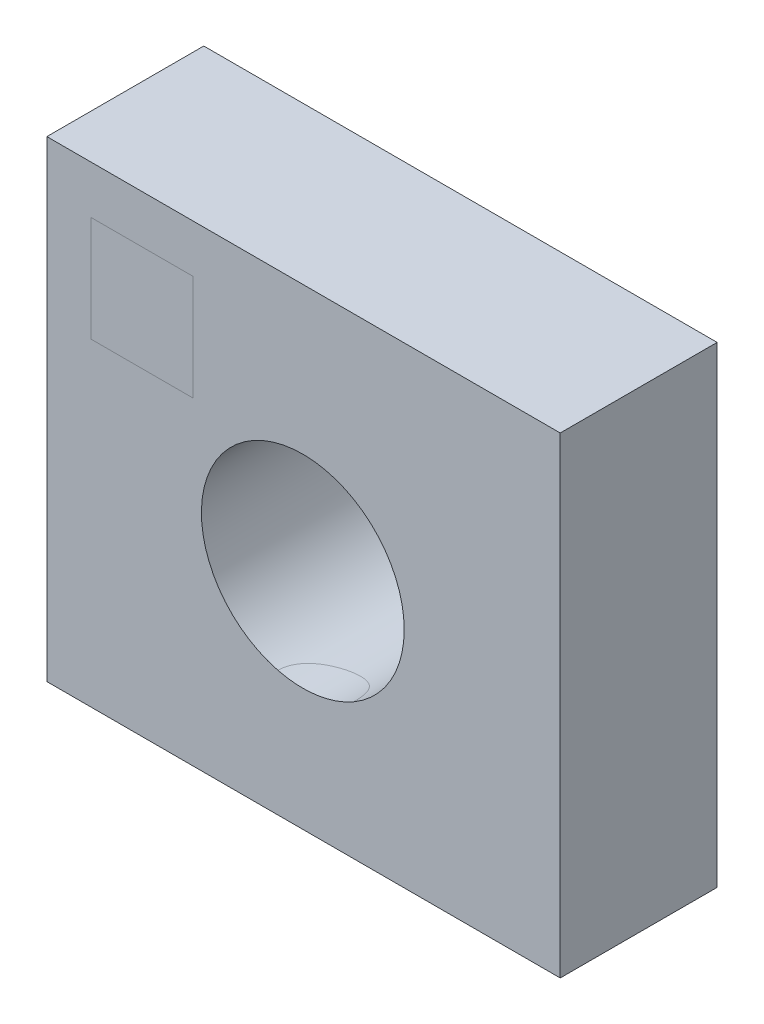
ISO-10303-21;
HEADER;
FILE_DESCRIPTION(('STEP AP214'),'2;1');
FILE_NAME('part.step','',(''),(''),'','','');
FILE_SCHEMA(('AUTOMOTIVE_DESIGN { 1 0 10303 214 1 1 1 1 }'));
ENDSEC;
DATA;
#1=APPLICATION_CONTEXT('core data for automotive mechanical design processes');
#2=APPLICATION_PROTOCOL_DEFINITION('international standard','automotive_design',2000,#1);
#3=PRODUCT_CONTEXT('',#1,'mechanical');
#4=PRODUCT('Part','Part','',(#3));
#5=PRODUCT_RELATED_PRODUCT_CATEGORY('part','',(#4));
#6=PRODUCT_DEFINITION_FORMATION('','',#4);
#7=PRODUCT_DEFINITION_CONTEXT('part definition',#1,'design');
#8=PRODUCT_DEFINITION('design','',#6,#7);
#9=PRODUCT_DEFINITION_SHAPE('','',#8);
#10=(LENGTH_UNIT() NAMED_UNIT(*) SI_UNIT(.MILLI.,.METRE.));
#11=(NAMED_UNIT(*) PLANE_ANGLE_UNIT() SI_UNIT($,.RADIAN.));
#12=(NAMED_UNIT(*) SI_UNIT($,.STERADIAN.) SOLID_ANGLE_UNIT());
#13=UNCERTAINTY_MEASURE_WITH_UNIT(LENGTH_MEASURE(1.E-05),#10,'distance_accuracy_value','');
#14=(GEOMETRIC_REPRESENTATION_CONTEXT(3) GLOBAL_UNCERTAINTY_ASSIGNED_CONTEXT((#13)) GLOBAL_UNIT_ASSIGNED_CONTEXT((#10,
#11,#12)) REPRESENTATION_CONTEXT('',''));
#15=CARTESIAN_POINT('',(0.,0.,0.));
#16=DIRECTION('',(0.,0.,1.));
#17=DIRECTION('',(1.,0.,0.));
#18=AXIS2_PLACEMENT_3D('',#15,#16,#17);
#19=CARTESIAN_POINT('',(24.4687143240419,-2.36667692441558,0.));
#20=DIRECTION('',(0.,0.,1.));
#21=DIRECTION('',(1.,0.,0.));
#22=AXIS2_PLACEMENT_3D('',#19,#20,#21);
#23=CYLINDRICAL_SURFACE('',#22,9.69330654183383);
#24=CARTESIAN_POINT('',(24.4687143240419,-2.36667692441558,0.));
#25=DIRECTION('',(0.,0.,1.));
#26=DIRECTION('',(1.,0.,0.));
#27=AXIS2_PLACEMENT_3D('',#24,#25,#26);
#28=CIRCLE('',#27,9.69330654183383);
#29=CARTESIAN_POINT('',(34.1620208658757,-2.36667692441558,0.));
#30=VERTEX_POINT('',#29);
#31=EDGE_CURVE('E181',#30,#30,#28,.T.);
#32=ORIENTED_EDGE('',*,*,#31,.F.);
#33=EDGE_LOOP('',(#32));
#34=FACE_BOUND('',#33,.T.);
#35=CARTESIAN_POINT('',(29.3366183103742,-10.7490216139287,15.));
#36=CARTESIAN_POINT('',(29.3366351722762,-10.7489986225201,14.905804152557));
#37=CARTESIAN_POINT('',(29.3329460981539,-10.7511539037152,14.8116221380623));
#38=CARTESIAN_POINT('',(29.3182878512393,-10.7596477057252,14.6240664206171));
#39=CARTESIAN_POINT('',(29.3073226677766,-10.7659839342086,14.5306923031183));
#40=CARTESIAN_POINT('',(29.2783235129637,-10.7826208935799,14.3459366399488));
#41=CARTESIAN_POINT('',(29.2603286694767,-10.7928996741401,14.2545469707467));
#42=CARTESIAN_POINT('',(29.217511713799,-10.8171040434748,14.0738928913908));
#43=CARTESIAN_POINT('',(29.1926889390554,-10.8310299861479,13.9846286883968));
#44=CARTESIAN_POINT('',(29.1084847419469,-10.8776618429872,13.7212392407514));
#45=CARTESIAN_POINT('',(29.0392853162216,-10.9152712020881,13.5510052914972));
#46=CARTESIAN_POINT('',(28.8772296469905,-10.9999561095559,13.2246888878504));
#47=CARTESIAN_POINT('',(28.7843404626671,-11.0470448196794,13.0686265523411));
#48=CARTESIAN_POINT('',(28.5694537807727,-11.150719436533,12.7618719245623));
#49=CARTESIAN_POINT('',(28.4457676684997,-11.2077571366734,12.6125144816788));
#50=CARTESIAN_POINT('',(28.1767301550934,-11.3239246849339,12.3357346717842));
#51=CARTESIAN_POINT('',(28.0313714091336,-11.3830552371177,12.2083197727418));
#52=CARTESIAN_POINT('',(27.7069879994461,-11.5048667368579,11.9668850313555));
#53=CARTESIAN_POINT('',(27.5260776630969,-11.5673522388338,11.8552831340355));
#54=CARTESIAN_POINT('',(27.1456262829017,-11.685149907794,11.6647126590289));
#55=CARTESIAN_POINT('',(26.9460873430764,-11.7404628832028,11.5857404014179));
#56=CARTESIAN_POINT('',(26.5384095280415,-11.8387118249347,11.4652711613366));
#57=CARTESIAN_POINT('',(26.3305830511377,-11.8819081611765,11.4229369261952));
#58=CARTESIAN_POINT('',(25.9084441310583,-11.9548541294647,11.3752839731654));
#59=CARTESIAN_POINT('',(25.6941357419198,-11.9846119881982,11.3699425804262));
#60=CARTESIAN_POINT('',(25.2836362382558,-12.0276954075231,11.396328133919));
#61=CARTESIAN_POINT('',(25.0873702297175,-12.0421471988739,11.4251172877855));
#62=CARTESIAN_POINT('',(24.7017107994413,-12.0591041891711,11.51451943702));
#63=CARTESIAN_POINT('',(24.5123163303009,-12.0616112164689,11.5751275603714));
#64=CARTESIAN_POINT('',(24.1517037891539,-12.056428378677,11.7240912496825));
#65=CARTESIAN_POINT('',(23.980108907501,-12.0490450967697,11.8115506777184));
#66=CARTESIAN_POINT('',(23.6532467833546,-12.0270117845648,12.012245917316));
#67=CARTESIAN_POINT('',(23.4979822140929,-12.012360566761,12.1254859395259));
#68=CARTESIAN_POINT('',(23.2025989760331,-11.9781298062119,12.3789970371581));
#69=CARTESIAN_POINT('',(23.0631742498675,-11.9583997143137,12.5200558839313));
#70=CARTESIAN_POINT('',(22.8091832748428,-11.9177362182685,12.8229232638567));
#71=CARTESIAN_POINT('',(22.6946253372709,-11.89680241475,12.9847387058752));
#72=CARTESIAN_POINT('',(22.4897878578078,-11.8564267516033,13.3309868390282));
#73=CARTESIAN_POINT('',(22.4004889972487,-11.8370618944642,13.5160096083043));
#74=CARTESIAN_POINT('',(22.2543513032544,-11.8039677443982,13.8988446380862));
#75=CARTESIAN_POINT('',(22.19748003053,-11.790232823385,14.0966438961281));
#76=CARTESIAN_POINT('',(22.1349029615546,-11.774867158866,14.4134051251966));
#77=CARTESIAN_POINT('',(22.1177223425763,-11.7705727281757,14.5300854819503));
#78=CARTESIAN_POINT('',(22.0948008535856,-11.7648032336689,14.7644905482152));
#79=CARTESIAN_POINT('',(22.0890462460262,-11.7633247842723,14.8822138324636));
#80=CARTESIAN_POINT('',(22.0890555668129,-11.7633473939543,15.));
#81=B_SPLINE_CURVE_WITH_KNOTS('',3,(#35,#36,#37,#38,#39,#40,#41,#42,#43,#44,#45,#46,#47,#48,#49,
#50,#51,#52,#53,#54,#55,#56,#57,#58,#59,#60,#61,#62,#63,#64,#65,#66,#67,#68,#69,#70,#71,#72,#73,
#74,#75,#76,#77,#78,#79,#80),.UNSPECIFIED.,.F.,.F.,(4,2,2,2,2,2,2,2,2,2,2,2,2,2,2,2,2,2,2,2,2,2,
4),(0.,0.282467933163131,0.564781123235189,0.845544817350262,1.12633576517707,1.68637514140296,
2.24719754409406,2.85112811691587,3.45526382818751,4.11672002908849,4.77810161152185,
5.42393688471377,6.06937625657466,6.66306444458707,7.25666175550263,7.83227785333734,
8.40798803192944,9.00326107068879,9.59873276369433,10.2148725519114,10.830394891743,
11.1839074537828,11.5369947280254),.UNSPECIFIED.);
#82=CARTESIAN_POINT('',(29.3366183103742,-10.7490216139287,15.));
#83=VERTEX_POINT('',#82);
#84=CARTESIAN_POINT('',(22.0890555668129,-11.7633473939543,15.));
#85=VERTEX_POINT('',#84);
#86=EDGE_CURVE('E11',#83,#85,#81,.T.);
#87=ORIENTED_EDGE('',*,*,#86,.F.);
#88=CARTESIAN_POINT('',(24.4687143240419,-2.36667692441558,15.));
#89=DIRECTION('',(0.,0.,1.));
#90=DIRECTION('',(1.,0.,0.));
#91=AXIS2_PLACEMENT_3D('',#88,#89,#90);
#92=CIRCLE('',#91,9.69330654183383);
#93=EDGE_CURVE('E182',#83,#85,#92,.T.);
#94=ORIENTED_EDGE('',*,*,#93,.T.);
#95=EDGE_LOOP('',(#87,#94));
#96=FACE_BOUND('',#95,.T.);
#97=ADVANCED_FACE('F39',(#34,#96),#23,.F.);
#98=CARTESIAN_POINT('',(0.,0.,15.));
#99=DIRECTION('',(0.,0.,-1.));
#100=DIRECTION('',(-1.,0.,0.));
#101=AXIS2_PLACEMENT_3D('',#98,#99,#100);
#102=PLANE('',#101);
#103=DIRECTION('',(0.,-1.,0.));
#104=VECTOR('',#103,1.);
#105=CARTESIAN_POINT('',(0.,-23.7459375614871,15.));
#106=LINE('',#105,#104);
#107=CARTESIAN_POINT('',(0.,21.3792446029707,15.));
#108=VERTEX_POINT('',#107);
#109=CARTESIAN_POINT('',(0.,-23.7459375614871,15.));
#110=VERTEX_POINT('',#109);
#111=EDGE_CURVE('E109',#108,#110,#106,.T.);
#112=ORIENTED_EDGE('',*,*,#111,.T.);
#113=DIRECTION('',(1.,0.,0.));
#114=VECTOR('',#113,1.);
#115=CARTESIAN_POINT('',(0.,-23.7459375614871,15.));
#116=LINE('',#115,#114);
#117=CARTESIAN_POINT('',(49.0779661016949,-23.7459375614871,15.));
#118=VERTEX_POINT('',#117);
#119=EDGE_CURVE('E98',#110,#118,#116,.T.);
#120=ORIENTED_EDGE('',*,*,#119,.T.);
#121=DIRECTION('',(0.,1.,0.));
#122=VECTOR('',#121,1.);
#123=CARTESIAN_POINT('',(49.0779661016949,-23.7459375614871,15.));
#124=LINE('',#123,#122);
#125=CARTESIAN_POINT('',(49.0779661016949,21.3792446029707,15.));
#126=VERTEX_POINT('',#125);
#127=EDGE_CURVE('E108',#118,#126,#124,.T.);
#128=ORIENTED_EDGE('',*,*,#127,.T.);
#129=DIRECTION('',(-1.,0.,0.));
#130=VECTOR('',#129,1.);
#131=CARTESIAN_POINT('',(0.,21.3792446029707,15.));
#132=LINE('',#131,#130);
#133=EDGE_CURVE('E115',#126,#108,#132,.T.);
#134=ORIENTED_EDGE('',*,*,#133,.T.);
#135=EDGE_LOOP('',(#112,#120,#128,#134));
#136=FACE_BOUND('',#135,.T.);
#137=EDGE_CURVE('E180',#85,#83,#92,.T.);
#138=ORIENTED_EDGE('',*,*,#137,.F.);
#139=ORIENTED_EDGE('',*,*,#93,.F.);
#140=EDGE_LOOP('',(#138,#139));
#141=FACE_BOUND('',#140,.T.);
#142=DIRECTION('',(0.,-1.,0.));
#143=VECTOR('',#142,1.);
#144=CARTESIAN_POINT('',(4.21201734658788,0.,15.));
#145=LINE('',#144,#143);
#146=CARTESIAN_POINT('',(4.21201734658788,16.7949128769854,15.));
#147=VERTEX_POINT('',#146);
#148=CARTESIAN_POINT('',(4.21201734658788,6.7187191382366,15.));
#149=VERTEX_POINT('',#148);
#150=EDGE_CURVE('E51',#147,#149,#145,.T.);
#151=ORIENTED_EDGE('',*,*,#150,.F.);
#152=DIRECTION('',(-1.,0.,0.));
#153=VECTOR('',#152,1.);
#154=CARTESIAN_POINT('',(0.,16.7949128769854,15.));
#155=LINE('',#154,#153);
#156=CARTESIAN_POINT('',(13.9488848691221,16.7949128769854,15.));
#157=VERTEX_POINT('',#156);
#158=EDGE_CURVE('E124',#157,#147,#155,.T.);
#159=ORIENTED_EDGE('',*,*,#158,.F.);
#160=DIRECTION('',(0.,1.,0.));
#161=VECTOR('',#160,1.);
#162=CARTESIAN_POINT('',(13.9488848691221,0.,15.));
#163=LINE('',#162,#161);
#164=CARTESIAN_POINT('',(13.9488848691221,6.7187191382366,15.));
#165=VERTEX_POINT('',#164);
#166=EDGE_CURVE('E128',#165,#157,#163,.T.);
#167=ORIENTED_EDGE('',*,*,#166,.F.);
#168=DIRECTION('',(1.,0.,0.));
#169=VECTOR('',#168,1.);
#170=CARTESIAN_POINT('',(0.,6.7187191382366,15.));
#171=LINE('',#170,#169);
#172=EDGE_CURVE('E136',#149,#165,#171,.T.);
#173=ORIENTED_EDGE('',*,*,#172,.F.);
#174=EDGE_LOOP('',(#151,#159,#167,#173));
#175=FACE_BOUND('',#174,.T.);
#176=ADVANCED_FACE('F112',(#136,#141,#175),#102,.F.);
#177=CARTESIAN_POINT('',(0.,-23.7459375614871,15.));
#178=DIRECTION('',(1.,0.,0.));
#179=DIRECTION('',(0.,0.,-1.));
#180=AXIS2_PLACEMENT_3D('',#177,#178,#179);
#181=PLANE('',#180);
#182=DIRECTION('',(0.,-1.,0.));
#183=VECTOR('',#182,1.);
#184=CARTESIAN_POINT('',(0.,-23.7459375614871,0.));
#185=LINE('',#184,#183);
#186=CARTESIAN_POINT('',(0.,21.3792446029707,0.));
#187=VERTEX_POINT('',#186);
#188=CARTESIAN_POINT('',(0.,-23.7459375614871,0.));
#189=VERTEX_POINT('',#188);
#190=EDGE_CURVE('E123',#187,#189,#185,.T.);
#191=ORIENTED_EDGE('',*,*,#190,.T.);
#192=DIRECTION('',(0.,0.,-1.));
#193=VECTOR('',#192,1.);
#194=CARTESIAN_POINT('',(0.,-23.7459375614871,15.));
#195=LINE('',#194,#193);
#196=EDGE_CURVE('E102',#110,#189,#195,.T.);
#197=ORIENTED_EDGE('',*,*,#196,.F.);
#198=ORIENTED_EDGE('',*,*,#111,.F.);
#199=DIRECTION('',(0.,0.,-1.));
#200=VECTOR('',#199,1.);
#201=CARTESIAN_POINT('',(0.,21.3792446029707,15.));
#202=LINE('',#201,#200);
#203=EDGE_CURVE('E189',#108,#187,#202,.T.);
#204=ORIENTED_EDGE('',*,*,#203,.T.);
#205=EDGE_LOOP('',(#191,#197,#198,#204));
#206=FACE_BOUND('',#205,.T.);
#207=ADVANCED_FACE('F121',(#206),#181,.F.);
#208=CARTESIAN_POINT('',(0.,-23.7459375614871,15.));
#209=DIRECTION('',(0.,1.,0.));
#210=DIRECTION('',(0.,0.,1.));
#211=AXIS2_PLACEMENT_3D('',#208,#209,#210);
#212=PLANE('',#211);
#213=DIRECTION('',(1.,0.,0.));
#214=VECTOR('',#213,1.);
#215=CARTESIAN_POINT('',(0.,-23.7459375614871,0.));
#216=LINE('',#215,#214);
#217=CARTESIAN_POINT('',(49.0779661016949,-23.7459375614871,0.));
#218=VERTEX_POINT('',#217);
#219=EDGE_CURVE('E191',#189,#218,#216,.T.);
#220=ORIENTED_EDGE('',*,*,#219,.T.);
#221=DIRECTION('',(0.,0.,-1.));
#222=VECTOR('',#221,1.);
#223=CARTESIAN_POINT('',(49.0779661016949,-23.7459375614871,15.));
#224=LINE('',#223,#222);
#225=EDGE_CURVE('E105',#118,#218,#224,.T.);
#226=ORIENTED_EDGE('',*,*,#225,.F.);
#227=ORIENTED_EDGE('',*,*,#119,.F.);
#228=ORIENTED_EDGE('',*,*,#196,.T.);
#229=EDGE_LOOP('',(#220,#226,#227,#228));
#230=FACE_BOUND('',#229,.T.);
#231=ADVANCED_FACE('F100',(#230),#212,.F.);
#232=CARTESIAN_POINT('',(49.0779661016949,-23.7459375614871,15.));
#233=DIRECTION('',(-1.,0.,0.));
#234=DIRECTION('',(0.,0.,1.));
#235=AXIS2_PLACEMENT_3D('',#232,#233,#234);
#236=PLANE('',#235);
#237=DIRECTION('',(0.,1.,0.));
#238=VECTOR('',#237,1.);
#239=CARTESIAN_POINT('',(49.0779661016949,-23.7459375614871,0.));
#240=LINE('',#239,#238);
#241=CARTESIAN_POINT('',(49.0779661016949,21.3792446029707,0.));
#242=VERTEX_POINT('',#241);
#243=EDGE_CURVE('E193',#218,#242,#240,.T.);
#244=ORIENTED_EDGE('',*,*,#243,.T.);
#245=DIRECTION('',(0.,0.,-1.));
#246=VECTOR('',#245,1.);
#247=CARTESIAN_POINT('',(49.0779661016949,21.3792446029707,15.));
#248=LINE('',#247,#246);
#249=EDGE_CURVE('E130',#126,#242,#248,.T.);
#250=ORIENTED_EDGE('',*,*,#249,.F.);
#251=ORIENTED_EDGE('',*,*,#127,.F.);
#252=ORIENTED_EDGE('',*,*,#225,.T.);
#253=EDGE_LOOP('',(#244,#250,#251,#252));
#254=FACE_BOUND('',#253,.T.);
#255=ADVANCED_FACE('F165',(#254),#236,.F.);
#256=CARTESIAN_POINT('',(0.,21.3792446029707,15.));
#257=DIRECTION('',(0.,-1.,0.));
#258=DIRECTION('',(0.,0.,-1.));
#259=AXIS2_PLACEMENT_3D('',#256,#257,#258);
#260=PLANE('',#259);
#261=DIRECTION('',(-1.,0.,0.));
#262=VECTOR('',#261,1.);
#263=CARTESIAN_POINT('',(0.,21.3792446029707,0.));
#264=LINE('',#263,#262);
#265=EDGE_CURVE('E119',#242,#187,#264,.T.);
#266=ORIENTED_EDGE('',*,*,#265,.T.);
#267=ORIENTED_EDGE('',*,*,#203,.F.);
#268=ORIENTED_EDGE('',*,*,#133,.F.);
#269=ORIENTED_EDGE('',*,*,#249,.T.);
#270=EDGE_LOOP('',(#266,#267,#268,#269));
#271=FACE_BOUND('',#270,.T.);
#272=ADVANCED_FACE('F159',(#271),#260,.F.);
#273=ORIENTED_EDGE('',*,*,#158,.T.);
#274=ORIENTED_EDGE('',*,*,#150,.T.);
#275=ORIENTED_EDGE('',*,*,#172,.T.);
#276=ORIENTED_EDGE('',*,*,#166,.T.);
#277=EDGE_LOOP('',(#273,#274,#275,#276));
#278=FACE_BOUND('',#277,.T.);
#279=ADVANCED_FACE('F143',(#278),#102,.F.);
#280=CARTESIAN_POINT('',(0.,0.,0.));
#281=DIRECTION('',(0.,0.,-1.));
#282=DIRECTION('',(-1.,0.,0.));
#283=AXIS2_PLACEMENT_3D('',#280,#281,#282);
#284=PLANE('',#283);
#285=ORIENTED_EDGE('',*,*,#31,.T.);
#286=EDGE_LOOP('',(#285));
#287=FACE_BOUND('',#286,.T.);
#288=ORIENTED_EDGE('',*,*,#190,.F.);
#289=ORIENTED_EDGE('',*,*,#265,.F.);
#290=ORIENTED_EDGE('',*,*,#243,.F.);
#291=ORIENTED_EDGE('',*,*,#219,.F.);
#292=EDGE_LOOP('',(#288,#289,#290,#291));
#293=FACE_BOUND('',#292,.T.);
#294=ADVANCED_FACE('F158',(#287,#293),#284,.T.);
#295=ORIENTED_EDGE('',*,*,#137,.T.);
#296=ORIENTED_EDGE('',*,*,#86,.T.);
#297=EDGE_LOOP('',(#295,#296));
#298=FACE_BOUND('',#297,.T.);
#299=ADVANCED_FACE('F155',(#298),#23,.F.);
#300=CLOSED_SHELL('',(#97,#176,#207,#231,#255,#272,#279,#294,#299));
#301=MANIFOLD_SOLID_BREP('B2',#300);
#302=ADVANCED_BREP_SHAPE_REPRESENTATION('',(#18,#301),#14);
#303=SHAPE_DEFINITION_REPRESENTATION(#9,#302);
ENDSEC;
END-ISO-10303-21;
